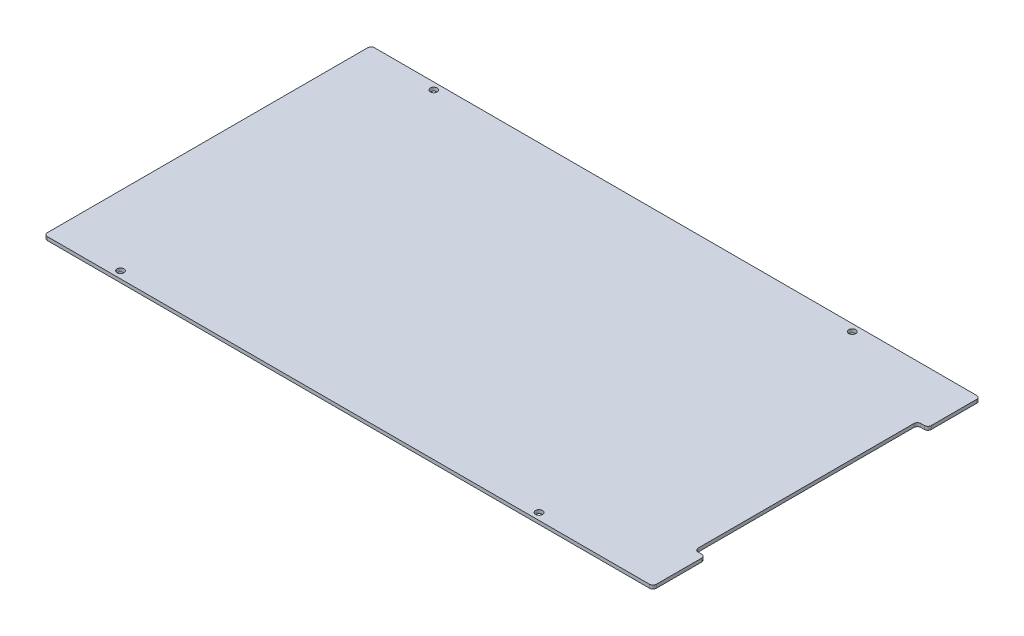
ISO-10303-21;
HEADER;
FILE_DESCRIPTION(('STEP AP214'),'2;1');
FILE_NAME('part.step','',(''),(''),'','','');
FILE_SCHEMA(('AUTOMOTIVE_DESIGN { 1 0 10303 214 1 1 1 1 }'));
ENDSEC;
DATA;
#1=APPLICATION_CONTEXT('core data for automotive mechanical design processes');
#2=APPLICATION_PROTOCOL_DEFINITION('international standard','automotive_design',2000,#1);
#3=PRODUCT_CONTEXT('',#1,'mechanical');
#4=PRODUCT('Part','Part','',(#3));
#5=PRODUCT_RELATED_PRODUCT_CATEGORY('part','',(#4));
#6=PRODUCT_DEFINITION_FORMATION('','',#4);
#7=PRODUCT_DEFINITION_CONTEXT('part definition',#1,'design');
#8=PRODUCT_DEFINITION('design','',#6,#7);
#9=PRODUCT_DEFINITION_SHAPE('','',#8);
#10=(LENGTH_UNIT() NAMED_UNIT(*) SI_UNIT(.MILLI.,.METRE.));
#11=(NAMED_UNIT(*) PLANE_ANGLE_UNIT() SI_UNIT($,.RADIAN.));
#12=(NAMED_UNIT(*) SI_UNIT($,.STERADIAN.) SOLID_ANGLE_UNIT());
#13=UNCERTAINTY_MEASURE_WITH_UNIT(LENGTH_MEASURE(1.E-05),#10,'distance_accuracy_value','');
#14=(GEOMETRIC_REPRESENTATION_CONTEXT(3) GLOBAL_UNCERTAINTY_ASSIGNED_CONTEXT((#13)) GLOBAL_UNIT_ASSIGNED_CONTEXT((#10,
#11,#12)) REPRESENTATION_CONTEXT('',''));
#15=CARTESIAN_POINT('',(0.,0.,0.));
#16=DIRECTION('',(0.,0.,1.));
#17=DIRECTION('',(1.,0.,0.));
#18=AXIS2_PLACEMENT_3D('',#15,#16,#17);
#19=CARTESIAN_POINT('',(277.8125,3.175,149.225));
#20=DIRECTION('',(-1.,0.,0.));
#21=DIRECTION('',(0.,0.,1.));
#22=AXIS2_PLACEMENT_3D('',#19,#20,#21);
#23=PLANE('',#22);
#24=DIRECTION('',(0.,0.,-1.));
#25=VECTOR('',#24,1.);
#26=CARTESIAN_POINT('',(277.8125,0.,149.225));
#27=LINE('',#26,#25);
#28=CARTESIAN_POINT('',(277.8125,0.,146.05));
#29=VERTEX_POINT('',#28);
#30=CARTESIAN_POINT('',(277.8125,0.,104.775));
#31=VERTEX_POINT('',#30);
#32=EDGE_CURVE('E201',#29,#31,#27,.T.);
#33=ORIENTED_EDGE('',*,*,#32,.T.);
#34=DIRECTION('',(0.,1.,0.));
#35=VECTOR('',#34,1.);
#36=CARTESIAN_POINT('',(277.8125,3.175,104.775));
#37=LINE('',#36,#35);
#38=CARTESIAN_POINT('',(277.8125,3.175,104.775));
#39=VERTEX_POINT('',#38);
#40=EDGE_CURVE('E254',#31,#39,#37,.T.);
#41=ORIENTED_EDGE('',*,*,#40,.T.);
#42=DIRECTION('',(0.,0.,-1.));
#43=VECTOR('',#42,1.);
#44=CARTESIAN_POINT('',(277.8125,3.175,149.225));
#45=LINE('',#44,#43);
#46=CARTESIAN_POINT('',(277.8125,3.175,146.05));
#47=VERTEX_POINT('',#46);
#48=EDGE_CURVE('E191',#47,#39,#45,.T.);
#49=ORIENTED_EDGE('',*,*,#48,.F.);
#50=DIRECTION('',(0.,-1.,0.));
#51=VECTOR('',#50,1.);
#52=CARTESIAN_POINT('',(277.8125,3.175,146.05));
#53=LINE('',#52,#51);
#54=EDGE_CURVE('E251',#47,#29,#53,.T.);
#55=ORIENTED_EDGE('',*,*,#54,.T.);
#56=EDGE_LOOP('',(#33,#41,#49,#55));
#57=FACE_BOUND('',#56,.T.);
#58=ADVANCED_FACE('F37',(#57),#23,.F.);
#59=CARTESIAN_POINT('',(277.8125,3.175,-104.775));
#60=VERTEX_POINT('',#59);
#61=CARTESIAN_POINT('',(277.8125,3.175,-146.05));
#62=VERTEX_POINT('',#61);
#63=EDGE_CURVE('E188',#60,#62,#45,.T.);
#64=ORIENTED_EDGE('',*,*,#63,.F.);
#65=DIRECTION('',(0.,1.,0.));
#66=VECTOR('',#65,1.);
#67=CARTESIAN_POINT('',(277.8125,3.175,-104.775));
#68=LINE('',#67,#66);
#69=CARTESIAN_POINT('',(277.8125,0.,-104.775));
#70=VERTEX_POINT('',#69);
#71=EDGE_CURVE('E239',#60,#70,#68,.F.);
#72=ORIENTED_EDGE('',*,*,#71,.T.);
#73=CARTESIAN_POINT('',(277.8125,0.,-146.05));
#74=VERTEX_POINT('',#73);
#75=EDGE_CURVE('E205',#70,#74,#27,.T.);
#76=ORIENTED_EDGE('',*,*,#75,.T.);
#77=DIRECTION('',(0.,-1.,0.));
#78=VECTOR('',#77,1.);
#79=CARTESIAN_POINT('',(277.8125,3.175,-146.05));
#80=LINE('',#79,#78);
#81=EDGE_CURVE('E237',#74,#62,#80,.F.);
#82=ORIENTED_EDGE('',*,*,#81,.T.);
#83=EDGE_LOOP('',(#64,#72,#76,#82));
#84=FACE_BOUND('',#83,.T.);
#85=ADVANCED_FACE('F304',(#84),#23,.F.);
#86=CARTESIAN_POINT('',(-277.8125,3.175,-149.225));
#87=DIRECTION('',(0.,0.,1.));
#88=DIRECTION('',(1.,0.,0.));
#89=AXIS2_PLACEMENT_3D('',#86,#87,#88);
#90=PLANE('',#89);
#91=DIRECTION('',(-1.,0.,0.));
#92=VECTOR('',#91,1.);
#93=CARTESIAN_POINT('',(-277.8125,3.175,-149.225));
#94=LINE('',#93,#92);
#95=CARTESIAN_POINT('',(274.6375,3.175,-149.225));
#96=VERTEX_POINT('',#95);
#97=CARTESIAN_POINT('',(-274.6375,3.175,-149.225));
#98=VERTEX_POINT('',#97);
#99=EDGE_CURVE('E193',#96,#98,#94,.T.);
#100=ORIENTED_EDGE('',*,*,#99,.F.);
#101=DIRECTION('',(0.,-1.,0.));
#102=VECTOR('',#101,1.);
#103=CARTESIAN_POINT('',(274.6375,3.175,-149.225));
#104=LINE('',#103,#102);
#105=CARTESIAN_POINT('',(274.6375,0.,-149.225));
#106=VERTEX_POINT('',#105);
#107=EDGE_CURVE('E261',#96,#106,#104,.T.);
#108=ORIENTED_EDGE('',*,*,#107,.T.);
#109=DIRECTION('',(-1.,0.,0.));
#110=VECTOR('',#109,1.);
#111=CARTESIAN_POINT('',(-277.8125,0.,-149.225));
#112=LINE('',#111,#110);
#113=CARTESIAN_POINT('',(-274.6375,0.,-149.225));
#114=VERTEX_POINT('',#113);
#115=EDGE_CURVE('E204',#106,#114,#112,.T.);
#116=ORIENTED_EDGE('',*,*,#115,.T.);
#117=DIRECTION('',(0.,-1.,0.));
#118=VECTOR('',#117,1.);
#119=CARTESIAN_POINT('',(-274.6375,3.175,-149.225));
#120=LINE('',#119,#118);
#121=EDGE_CURVE('E259',#114,#98,#120,.F.);
#122=ORIENTED_EDGE('',*,*,#121,.T.);
#123=EDGE_LOOP('',(#100,#108,#116,#122));
#124=FACE_BOUND('',#123,.T.);
#125=ADVANCED_FACE('F297',(#124),#90,.F.);
#126=CARTESIAN_POINT('',(-277.8125,3.175,149.225));
#127=DIRECTION('',(1.,0.,0.));
#128=DIRECTION('',(0.,0.,-1.));
#129=AXIS2_PLACEMENT_3D('',#126,#127,#128);
#130=PLANE('',#129);
#131=DIRECTION('',(0.,0.,1.));
#132=VECTOR('',#131,1.);
#133=CARTESIAN_POINT('',(-277.8125,3.175,149.225));
#134=LINE('',#133,#132);
#135=CARTESIAN_POINT('',(-277.8125,3.175,-146.05));
#136=VERTEX_POINT('',#135);
#137=CARTESIAN_POINT('',(-277.8125,3.175,146.05));
#138=VERTEX_POINT('',#137);
#139=EDGE_CURVE('E196',#136,#138,#134,.T.);
#140=ORIENTED_EDGE('',*,*,#139,.F.);
#141=DIRECTION('',(0.,-1.,0.));
#142=VECTOR('',#141,1.);
#143=CARTESIAN_POINT('',(-277.8125,3.175,-146.05));
#144=LINE('',#143,#142);
#145=CARTESIAN_POINT('',(-277.8125,0.,-146.05));
#146=VERTEX_POINT('',#145);
#147=EDGE_CURVE('E265',#136,#146,#144,.T.);
#148=ORIENTED_EDGE('',*,*,#147,.T.);
#149=DIRECTION('',(0.,0.,1.));
#150=VECTOR('',#149,1.);
#151=CARTESIAN_POINT('',(-277.8125,0.,149.225));
#152=LINE('',#151,#150);
#153=CARTESIAN_POINT('',(-277.8125,0.,146.05));
#154=VERTEX_POINT('',#153);
#155=EDGE_CURVE('E207',#146,#154,#152,.T.);
#156=ORIENTED_EDGE('',*,*,#155,.T.);
#157=DIRECTION('',(0.,-1.,0.));
#158=VECTOR('',#157,1.);
#159=CARTESIAN_POINT('',(-277.8125,3.175,146.05));
#160=LINE('',#159,#158);
#161=EDGE_CURVE('E263',#154,#138,#160,.F.);
#162=ORIENTED_EDGE('',*,*,#161,.T.);
#163=EDGE_LOOP('',(#140,#148,#156,#162));
#164=FACE_BOUND('',#163,.T.);
#165=ADVANCED_FACE('F289',(#164),#130,.F.);
#166=CARTESIAN_POINT('',(-277.8125,3.175,149.225));
#167=DIRECTION('',(0.,0.,-1.));
#168=DIRECTION('',(-1.,0.,0.));
#169=AXIS2_PLACEMENT_3D('',#166,#167,#168);
#170=PLANE('',#169);
#171=DIRECTION('',(1.,0.,0.));
#172=VECTOR('',#171,1.);
#173=CARTESIAN_POINT('',(-277.8125,0.,149.225));
#174=LINE('',#173,#172);
#175=CARTESIAN_POINT('',(-274.6375,0.,149.225));
#176=VERTEX_POINT('',#175);
#177=CARTESIAN_POINT('',(274.6375,0.,149.225));
#178=VERTEX_POINT('',#177);
#179=EDGE_CURVE('E192',#176,#178,#174,.T.);
#180=ORIENTED_EDGE('',*,*,#179,.T.);
#181=DIRECTION('',(0.,-1.,0.));
#182=VECTOR('',#181,1.);
#183=CARTESIAN_POINT('',(274.6375,3.175,149.225));
#184=LINE('',#183,#182);
#185=CARTESIAN_POINT('',(274.6375,3.175,149.225));
#186=VERTEX_POINT('',#185);
#187=EDGE_CURVE('E11',#178,#186,#184,.F.);
#188=ORIENTED_EDGE('',*,*,#187,.T.);
#189=DIRECTION('',(1.,0.,0.));
#190=VECTOR('',#189,1.);
#191=CARTESIAN_POINT('',(-277.8125,3.175,149.225));
#192=LINE('',#191,#190);
#193=CARTESIAN_POINT('',(-274.6375,3.175,149.225));
#194=VERTEX_POINT('',#193);
#195=EDGE_CURVE('E173',#194,#186,#192,.T.);
#196=ORIENTED_EDGE('',*,*,#195,.F.);
#197=DIRECTION('',(0.,-1.,0.));
#198=VECTOR('',#197,1.);
#199=CARTESIAN_POINT('',(-274.6375,3.175,149.225));
#200=LINE('',#199,#198);
#201=EDGE_CURVE('E45',#194,#176,#200,.T.);
#202=ORIENTED_EDGE('',*,*,#201,.T.);
#203=EDGE_LOOP('',(#180,#188,#196,#202));
#204=FACE_BOUND('',#203,.T.);
#205=ADVANCED_FACE('F272',(#204),#170,.F.);
#206=CARTESIAN_POINT('',(0.,3.175,0.));
#207=DIRECTION('',(0.,-1.,0.));
#208=DIRECTION('',(0.,0.,-1.));
#209=AXIS2_PLACEMENT_3D('',#206,#207,#208);
#210=PLANE('',#209);
#211=CARTESIAN_POINT('',(167.5765,3.175,-142.875));
#212=DIRECTION('',(0.,-1.,0.));
#213=DIRECTION('',(0.,0.,-1.));
#214=AXIS2_PLACEMENT_3D('',#211,#212,#213);
#215=CIRCLE('',#214,3.17500000000001);
#216=CARTESIAN_POINT('',(167.5765,3.175,-146.05));
#217=VERTEX_POINT('',#216);
#218=EDGE_CURVE('E332',#217,#217,#215,.T.);
#219=ORIENTED_EDGE('',*,*,#218,.T.);
#220=EDGE_LOOP('',(#219));
#221=FACE_BOUND('',#220,.T.);
#222=CARTESIAN_POINT('',(-214.3125,3.175,-142.875));
#223=DIRECTION('',(0.,-1.,0.));
#224=DIRECTION('',(0.,0.,-1.));
#225=AXIS2_PLACEMENT_3D('',#222,#223,#224);
#226=CIRCLE('',#225,3.17500000000001);
#227=CARTESIAN_POINT('',(-214.3125,3.175,-146.05));
#228=VERTEX_POINT('',#227);
#229=EDGE_CURVE('E326',#228,#228,#226,.T.);
#230=ORIENTED_EDGE('',*,*,#229,.T.);
#231=EDGE_LOOP('',(#230));
#232=FACE_BOUND('',#231,.T.);
#233=CARTESIAN_POINT('',(167.5765,3.175,142.875));
#234=DIRECTION('',(0.,-1.,0.));
#235=DIRECTION('',(0.,0.,-1.));
#236=AXIS2_PLACEMENT_3D('',#233,#234,#235);
#237=CIRCLE('',#236,3.17500000000001);
#238=CARTESIAN_POINT('',(167.5765,3.175,139.7));
#239=VERTEX_POINT('',#238);
#240=EDGE_CURVE('E318',#239,#239,#237,.T.);
#241=ORIENTED_EDGE('',*,*,#240,.T.);
#242=EDGE_LOOP('',(#241));
#243=FACE_BOUND('',#242,.T.);
#244=CARTESIAN_POINT('',(-214.3125,3.175,142.875));
#245=DIRECTION('',(0.,-1.,0.));
#246=DIRECTION('',(0.,0.,-1.));
#247=AXIS2_PLACEMENT_3D('',#244,#245,#246);
#248=CIRCLE('',#247,3.17500000000001);
#249=CARTESIAN_POINT('',(-214.3125,3.175,139.7));
#250=VERTEX_POINT('',#249);
#251=EDGE_CURVE('E310',#250,#250,#248,.T.);
#252=ORIENTED_EDGE('',*,*,#251,.T.);
#253=EDGE_LOOP('',(#252));
#254=FACE_BOUND('',#253,.T.);
#255=DIRECTION('',(-1.,0.,0.));
#256=VECTOR('',#255,1.);
#257=CARTESIAN_POINT('',(277.8125,3.175,-101.6));
#258=LINE('',#257,#256);
#259=CARTESIAN_POINT('',(274.6375,3.175,-101.6));
#260=VERTEX_POINT('',#259);
#261=CARTESIAN_POINT('',(271.4625,3.175,-101.6));
#262=VERTEX_POINT('',#261);
#263=EDGE_CURVE('E184',#260,#262,#258,.T.);
#264=ORIENTED_EDGE('',*,*,#263,.F.);
#265=CARTESIAN_POINT('',(274.6375,3.175,-104.775));
#266=DIRECTION('',(0.,-1.,0.));
#267=DIRECTION('',(0.,0.,-1.));
#268=AXIS2_PLACEMENT_3D('',#265,#266,#267);
#269=CIRCLE('',#268,3.175);
#270=EDGE_CURVE('E235',#260,#60,#269,.F.);
#271=ORIENTED_EDGE('',*,*,#270,.T.);
#272=ORIENTED_EDGE('',*,*,#63,.T.);
#273=CARTESIAN_POINT('',(274.6375,3.175,-146.05));
#274=DIRECTION('',(0.,-1.,0.));
#275=DIRECTION('',(0.,0.,-1.));
#276=AXIS2_PLACEMENT_3D('',#273,#274,#275);
#277=CIRCLE('',#276,3.175);
#278=EDGE_CURVE('E232',#62,#96,#277,.F.);
#279=ORIENTED_EDGE('',*,*,#278,.T.);
#280=ORIENTED_EDGE('',*,*,#99,.T.);
#281=CARTESIAN_POINT('',(-274.6375,3.175,-146.05));
#282=DIRECTION('',(0.,-1.,0.));
#283=DIRECTION('',(0.,0.,-1.));
#284=AXIS2_PLACEMENT_3D('',#281,#282,#283);
#285=CIRCLE('',#284,3.175);
#286=EDGE_CURVE('E230',#98,#136,#285,.F.);
#287=ORIENTED_EDGE('',*,*,#286,.T.);
#288=ORIENTED_EDGE('',*,*,#139,.T.);
#289=CARTESIAN_POINT('',(-274.6375,3.175,146.05));
#290=DIRECTION('',(0.,-1.,0.));
#291=DIRECTION('',(0.,0.,-1.));
#292=AXIS2_PLACEMENT_3D('',#289,#290,#291);
#293=CIRCLE('',#292,3.175);
#294=EDGE_CURVE('E226',#138,#194,#293,.F.);
#295=ORIENTED_EDGE('',*,*,#294,.T.);
#296=ORIENTED_EDGE('',*,*,#195,.T.);
#297=CARTESIAN_POINT('',(274.6375,3.175,146.05));
#298=DIRECTION('',(0.,-1.,0.));
#299=DIRECTION('',(0.,0.,-1.));
#300=AXIS2_PLACEMENT_3D('',#297,#298,#299);
#301=CIRCLE('',#300,3.175);
#302=EDGE_CURVE('E228',#186,#47,#301,.F.);
#303=ORIENTED_EDGE('',*,*,#302,.T.);
#304=ORIENTED_EDGE('',*,*,#48,.T.);
#305=CARTESIAN_POINT('',(274.6375,3.175,104.775));
#306=DIRECTION('',(0.,-1.,0.));
#307=DIRECTION('',(0.,0.,-1.));
#308=AXIS2_PLACEMENT_3D('',#305,#306,#307);
#309=CIRCLE('',#308,3.175);
#310=CARTESIAN_POINT('',(274.6375,3.175,101.6));
#311=VERTEX_POINT('',#310);
#312=EDGE_CURVE('E178',#39,#311,#309,.F.);
#313=ORIENTED_EDGE('',*,*,#312,.T.);
#314=DIRECTION('',(1.,0.,0.));
#315=VECTOR('',#314,1.);
#316=CARTESIAN_POINT('',(277.8125,3.175,101.6));
#317=LINE('',#316,#315);
#318=CARTESIAN_POINT('',(271.4625,3.175,101.6));
#319=VERTEX_POINT('',#318);
#320=EDGE_CURVE('E168',#319,#311,#317,.T.);
#321=ORIENTED_EDGE('',*,*,#320,.F.);
#322=CARTESIAN_POINT('',(271.4625,3.175,98.425));
#323=DIRECTION('',(0.,-1.,0.));
#324=DIRECTION('',(0.,0.,-1.));
#325=AXIS2_PLACEMENT_3D('',#322,#323,#324);
#326=CIRCLE('',#325,3.175);
#327=CARTESIAN_POINT('',(268.2875,3.175,98.425));
#328=VERTEX_POINT('',#327);
#329=EDGE_CURVE('E151',#319,#328,#326,.T.);
#330=ORIENTED_EDGE('',*,*,#329,.T.);
#331=DIRECTION('',(0.,0.,1.));
#332=VECTOR('',#331,1.);
#333=CARTESIAN_POINT('',(268.2875,3.175,-101.6));
#334=LINE('',#333,#332);
#335=CARTESIAN_POINT('',(268.2875,3.175,-98.425));
#336=VERTEX_POINT('',#335);
#337=EDGE_CURVE('E180',#336,#328,#334,.T.);
#338=ORIENTED_EDGE('',*,*,#337,.F.);
#339=CARTESIAN_POINT('',(271.4625,3.175,-98.425));
#340=DIRECTION('',(0.,-1.,0.));
#341=DIRECTION('',(0.,0.,-1.));
#342=AXIS2_PLACEMENT_3D('',#339,#340,#341);
#343=CIRCLE('',#342,3.175);
#344=EDGE_CURVE('E218',#336,#262,#343,.T.);
#345=ORIENTED_EDGE('',*,*,#344,.T.);
#346=EDGE_LOOP('',(#264,#271,#272,#279,#280,#287,#288,#295,#296,#303,#304,#313,#321,#330,#338,#345));
#347=FACE_BOUND('',#346,.T.);
#348=ADVANCED_FACE('F176',(#221,#232,#243,#254,#347),#210,.F.);
#349=CARTESIAN_POINT('',(0.,0.,0.));
#350=DIRECTION('',(0.,-1.,0.));
#351=DIRECTION('',(0.,0.,-1.));
#352=AXIS2_PLACEMENT_3D('',#349,#350,#351);
#353=PLANE('',#352);
#354=CARTESIAN_POINT('',(167.5765,0.,-142.875));
#355=DIRECTION('',(0.,-1.,0.));
#356=DIRECTION('',(0.,0.,-1.));
#357=AXIS2_PLACEMENT_3D('',#354,#355,#356);
#358=CIRCLE('',#357,3.17499999999998);
#359=CARTESIAN_POINT('',(167.5765,0.,-146.05));
#360=VERTEX_POINT('',#359);
#361=EDGE_CURVE('E335',#360,#360,#358,.T.);
#362=ORIENTED_EDGE('',*,*,#361,.F.);
#363=EDGE_LOOP('',(#362));
#364=FACE_BOUND('',#363,.T.);
#365=CARTESIAN_POINT('',(-214.3125,0.,-142.875));
#366=DIRECTION('',(0.,-1.,0.));
#367=DIRECTION('',(0.,0.,-1.));
#368=AXIS2_PLACEMENT_3D('',#365,#366,#367);
#369=CIRCLE('',#368,3.17499999999998);
#370=CARTESIAN_POINT('',(-214.3125,0.,-146.05));
#371=VERTEX_POINT('',#370);
#372=EDGE_CURVE('E329',#371,#371,#369,.T.);
#373=ORIENTED_EDGE('',*,*,#372,.F.);
#374=EDGE_LOOP('',(#373));
#375=FACE_BOUND('',#374,.T.);
#376=CARTESIAN_POINT('',(167.5765,0.,142.875));
#377=DIRECTION('',(0.,-1.,0.));
#378=DIRECTION('',(0.,0.,-1.));
#379=AXIS2_PLACEMENT_3D('',#376,#377,#378);
#380=CIRCLE('',#379,3.17499999999998);
#381=CARTESIAN_POINT('',(167.5765,0.,139.7));
#382=VERTEX_POINT('',#381);
#383=EDGE_CURVE('E323',#382,#382,#380,.T.);
#384=ORIENTED_EDGE('',*,*,#383,.F.);
#385=EDGE_LOOP('',(#384));
#386=FACE_BOUND('',#385,.T.);
#387=CARTESIAN_POINT('',(-214.3125,0.,142.875));
#388=DIRECTION('',(0.,-1.,0.));
#389=DIRECTION('',(0.,0.,-1.));
#390=AXIS2_PLACEMENT_3D('',#387,#388,#389);
#391=CIRCLE('',#390,3.17499999999998);
#392=CARTESIAN_POINT('',(-214.3125,0.,139.7));
#393=VERTEX_POINT('',#392);
#394=EDGE_CURVE('E313',#393,#393,#391,.T.);
#395=ORIENTED_EDGE('',*,*,#394,.F.);
#396=EDGE_LOOP('',(#395));
#397=FACE_BOUND('',#396,.T.);
#398=ORIENTED_EDGE('',*,*,#75,.F.);
#399=CARTESIAN_POINT('',(274.6375,0.,-104.775));
#400=DIRECTION('',(0.,-1.,0.));
#401=DIRECTION('',(0.,0.,-1.));
#402=AXIS2_PLACEMENT_3D('',#399,#400,#401);
#403=CIRCLE('',#402,3.175);
#404=CARTESIAN_POINT('',(274.6375,0.,-101.6));
#405=VERTEX_POINT('',#404);
#406=EDGE_CURVE('E249',#70,#405,#403,.T.);
#407=ORIENTED_EDGE('',*,*,#406,.T.);
#408=DIRECTION('',(-1.,0.,0.));
#409=VECTOR('',#408,1.);
#410=CARTESIAN_POINT('',(277.8125,0.,-101.6));
#411=LINE('',#410,#409);
#412=CARTESIAN_POINT('',(271.4625,0.,-101.6));
#413=VERTEX_POINT('',#412);
#414=EDGE_CURVE('E179',#405,#413,#411,.T.);
#415=ORIENTED_EDGE('',*,*,#414,.T.);
#416=CARTESIAN_POINT('',(271.4625,0.,-98.425));
#417=DIRECTION('',(0.,-1.,0.));
#418=DIRECTION('',(0.,0.,-1.));
#419=AXIS2_PLACEMENT_3D('',#416,#417,#418);
#420=CIRCLE('',#419,3.175);
#421=CARTESIAN_POINT('',(268.2875,0.,-98.425));
#422=VERTEX_POINT('',#421);
#423=EDGE_CURVE('E221',#413,#422,#420,.F.);
#424=ORIENTED_EDGE('',*,*,#423,.T.);
#425=DIRECTION('',(0.,0.,1.));
#426=VECTOR('',#425,1.);
#427=CARTESIAN_POINT('',(268.2875,0.,-101.6));
#428=LINE('',#427,#426);
#429=CARTESIAN_POINT('',(268.2875,0.,98.425));
#430=VERTEX_POINT('',#429);
#431=EDGE_CURVE('E182',#422,#430,#428,.T.);
#432=ORIENTED_EDGE('',*,*,#431,.T.);
#433=CARTESIAN_POINT('',(271.4625,0.,98.425));
#434=DIRECTION('',(0.,-1.,0.));
#435=DIRECTION('',(0.,0.,-1.));
#436=AXIS2_PLACEMENT_3D('',#433,#434,#435);
#437=CIRCLE('',#436,3.175);
#438=CARTESIAN_POINT('',(271.4625,0.,101.6));
#439=VERTEX_POINT('',#438);
#440=EDGE_CURVE('E161',#430,#439,#437,.F.);
#441=ORIENTED_EDGE('',*,*,#440,.T.);
#442=DIRECTION('',(1.,0.,0.));
#443=VECTOR('',#442,1.);
#444=CARTESIAN_POINT('',(277.8125,0.,101.6));
#445=LINE('',#444,#443);
#446=CARTESIAN_POINT('',(274.6375,0.,101.6));
#447=VERTEX_POINT('',#446);
#448=EDGE_CURVE('E171',#439,#447,#445,.T.);
#449=ORIENTED_EDGE('',*,*,#448,.T.);
#450=CARTESIAN_POINT('',(274.6375,0.,104.775));
#451=DIRECTION('',(0.,-1.,0.));
#452=DIRECTION('',(0.,0.,-1.));
#453=AXIS2_PLACEMENT_3D('',#450,#451,#452);
#454=CIRCLE('',#453,3.175);
#455=EDGE_CURVE('E247',#447,#31,#454,.T.);
#456=ORIENTED_EDGE('',*,*,#455,.T.);
#457=ORIENTED_EDGE('',*,*,#32,.F.);
#458=CARTESIAN_POINT('',(274.6375,0.,146.05));
#459=DIRECTION('',(0.,-1.,0.));
#460=DIRECTION('',(0.,0.,-1.));
#461=AXIS2_PLACEMENT_3D('',#458,#459,#460);
#462=CIRCLE('',#461,3.175);
#463=EDGE_CURVE('E243',#29,#178,#462,.T.);
#464=ORIENTED_EDGE('',*,*,#463,.T.);
#465=ORIENTED_EDGE('',*,*,#179,.F.);
#466=CARTESIAN_POINT('',(-274.6375,0.,146.05));
#467=DIRECTION('',(0.,-1.,0.));
#468=DIRECTION('',(0.,0.,-1.));
#469=AXIS2_PLACEMENT_3D('',#466,#467,#468);
#470=CIRCLE('',#469,3.175);
#471=EDGE_CURVE('E241',#176,#154,#470,.T.);
#472=ORIENTED_EDGE('',*,*,#471,.T.);
#473=ORIENTED_EDGE('',*,*,#155,.F.);
#474=CARTESIAN_POINT('',(-274.6375,0.,-146.05));
#475=DIRECTION('',(0.,-1.,0.));
#476=DIRECTION('',(0.,0.,-1.));
#477=AXIS2_PLACEMENT_3D('',#474,#475,#476);
#478=CIRCLE('',#477,3.175);
#479=EDGE_CURVE('E52',#146,#114,#478,.T.);
#480=ORIENTED_EDGE('',*,*,#479,.T.);
#481=ORIENTED_EDGE('',*,*,#115,.F.);
#482=CARTESIAN_POINT('',(274.6375,0.,-146.05));
#483=DIRECTION('',(0.,-1.,0.));
#484=DIRECTION('',(0.,0.,-1.));
#485=AXIS2_PLACEMENT_3D('',#482,#483,#484);
#486=CIRCLE('',#485,3.175);
#487=EDGE_CURVE('E60',#106,#74,#486,.T.);
#488=ORIENTED_EDGE('',*,*,#487,.T.);
#489=EDGE_LOOP('',(#398,#407,#415,#424,#432,#441,#449,#456,#457,#464,#465,#472,#473,#480,#481,#488));
#490=FACE_BOUND('',#489,.T.);
#491=ADVANCED_FACE('F277',(#364,#375,#386,#397,#490),#353,.T.);
#492=CARTESIAN_POINT('',(277.8125,0.,101.6));
#493=DIRECTION('',(0.,0.,1.));
#494=DIRECTION('',(1.,0.,0.));
#495=AXIS2_PLACEMENT_3D('',#492,#493,#494);
#496=PLANE('',#495);
#497=ORIENTED_EDGE('',*,*,#320,.T.);
#498=DIRECTION('',(0.,1.,0.));
#499=VECTOR('',#498,1.);
#500=CARTESIAN_POINT('',(274.6375,0.,101.6));
#501=LINE('',#500,#499);
#502=EDGE_CURVE('E257',#311,#447,#501,.F.);
#503=ORIENTED_EDGE('',*,*,#502,.T.);
#504=ORIENTED_EDGE('',*,*,#448,.F.);
#505=DIRECTION('',(0.,1.,0.));
#506=VECTOR('',#505,1.);
#507=CARTESIAN_POINT('',(271.4625,3.175,101.6));
#508=LINE('',#507,#506);
#509=EDGE_CURVE('E155',#439,#319,#508,.T.);
#510=ORIENTED_EDGE('',*,*,#509,.T.);
#511=EDGE_LOOP('',(#497,#503,#504,#510));
#512=FACE_BOUND('',#511,.T.);
#513=ADVANCED_FACE('F167',(#512),#496,.F.);
#514=CARTESIAN_POINT('',(268.2875,0.,-101.6));
#515=DIRECTION('',(-1.,0.,0.));
#516=DIRECTION('',(0.,0.,1.));
#517=AXIS2_PLACEMENT_3D('',#514,#515,#516);
#518=PLANE('',#517);
#519=ORIENTED_EDGE('',*,*,#337,.T.);
#520=DIRECTION('',(0.,1.,0.));
#521=VECTOR('',#520,1.);
#522=CARTESIAN_POINT('',(268.2875,0.,98.425));
#523=LINE('',#522,#521);
#524=EDGE_CURVE('E156',#328,#430,#523,.F.);
#525=ORIENTED_EDGE('',*,*,#524,.T.);
#526=ORIENTED_EDGE('',*,*,#431,.F.);
#527=DIRECTION('',(0.,1.,0.));
#528=VECTOR('',#527,1.);
#529=CARTESIAN_POINT('',(268.2875,3.175,-98.425));
#530=LINE('',#529,#528);
#531=EDGE_CURVE('E172',#422,#336,#530,.T.);
#532=ORIENTED_EDGE('',*,*,#531,.T.);
#533=EDGE_LOOP('',(#519,#525,#526,#532));
#534=FACE_BOUND('',#533,.T.);
#535=ADVANCED_FACE('F448',(#534),#518,.F.);
#536=CARTESIAN_POINT('',(277.8125,0.,-101.6));
#537=DIRECTION('',(0.,0.,-1.));
#538=DIRECTION('',(-1.,0.,0.));
#539=AXIS2_PLACEMENT_3D('',#536,#537,#538);
#540=PLANE('',#539);
#541=ORIENTED_EDGE('',*,*,#414,.F.);
#542=DIRECTION('',(0.,1.,0.));
#543=VECTOR('',#542,1.);
#544=CARTESIAN_POINT('',(274.6375,0.,-101.6));
#545=LINE('',#544,#543);
#546=EDGE_CURVE('E223',#405,#260,#545,.T.);
#547=ORIENTED_EDGE('',*,*,#546,.T.);
#548=ORIENTED_EDGE('',*,*,#263,.T.);
#549=DIRECTION('',(0.,1.,0.));
#550=VECTOR('',#549,1.);
#551=CARTESIAN_POINT('',(271.4625,0.,-101.6));
#552=LINE('',#551,#550);
#553=EDGE_CURVE('E162',#262,#413,#552,.F.);
#554=ORIENTED_EDGE('',*,*,#553,.T.);
#555=EDGE_LOOP('',(#541,#547,#548,#554));
#556=FACE_BOUND('',#555,.T.);
#557=ADVANCED_FACE('F376',(#556),#540,.F.);
#558=CARTESIAN_POINT('',(271.4625,0.,98.425));
#559=DIRECTION('',(0.,-1.,0.));
#560=DIRECTION('',(0.,0.,-1.));
#561=AXIS2_PLACEMENT_3D('',#558,#559,#560);
#562=CYLINDRICAL_SURFACE('',#561,3.175);
#563=ORIENTED_EDGE('',*,*,#440,.F.);
#564=ORIENTED_EDGE('',*,*,#524,.F.);
#565=ORIENTED_EDGE('',*,*,#329,.F.);
#566=ORIENTED_EDGE('',*,*,#509,.F.);
#567=EDGE_LOOP('',(#563,#564,#565,#566));
#568=FACE_BOUND('',#567,.T.);
#569=ADVANCED_FACE('F154',(#568),#562,.F.);
#570=CARTESIAN_POINT('',(271.4625,0.,-98.425));
#571=DIRECTION('',(0.,-1.,0.));
#572=DIRECTION('',(0.,0.,-1.));
#573=AXIS2_PLACEMENT_3D('',#570,#571,#572);
#574=CYLINDRICAL_SURFACE('',#573,3.175);
#575=ORIENTED_EDGE('',*,*,#423,.F.);
#576=ORIENTED_EDGE('',*,*,#553,.F.);
#577=ORIENTED_EDGE('',*,*,#344,.F.);
#578=ORIENTED_EDGE('',*,*,#531,.F.);
#579=EDGE_LOOP('',(#575,#576,#577,#578));
#580=FACE_BOUND('',#579,.T.);
#581=ADVANCED_FACE('F353',(#580),#574,.F.);
#582=CARTESIAN_POINT('',(-214.3125,0.,142.875));
#583=DIRECTION('',(0.,-1.,0.));
#584=DIRECTION('',(0.,0.,-1.));
#585=AXIS2_PLACEMENT_3D('',#582,#583,#584);
#586=CYLINDRICAL_SURFACE('',#585,3.175);
#587=ORIENTED_EDGE('',*,*,#251,.F.);
#588=EDGE_LOOP('',(#587));
#589=FACE_BOUND('',#588,.T.);
#590=ORIENTED_EDGE('',*,*,#394,.T.);
#591=EDGE_LOOP('',(#590));
#592=FACE_BOUND('',#591,.T.);
#593=ADVANCED_FACE('F350',(#589,#592),#586,.F.);
#594=CARTESIAN_POINT('',(167.5765,0.,142.875));
#595=DIRECTION('',(0.,-1.,0.));
#596=DIRECTION('',(0.,0.,-1.));
#597=AXIS2_PLACEMENT_3D('',#594,#595,#596);
#598=CYLINDRICAL_SURFACE('',#597,3.175);
#599=ORIENTED_EDGE('',*,*,#240,.F.);
#600=EDGE_LOOP('',(#599));
#601=FACE_BOUND('',#600,.T.);
#602=ORIENTED_EDGE('',*,*,#383,.T.);
#603=EDGE_LOOP('',(#602));
#604=FACE_BOUND('',#603,.T.);
#605=ADVANCED_FACE('F352',(#601,#604),#598,.F.);
#606=CARTESIAN_POINT('',(-214.3125,0.,-142.875));
#607=DIRECTION('',(0.,-1.,0.));
#608=DIRECTION('',(0.,0.,-1.));
#609=AXIS2_PLACEMENT_3D('',#606,#607,#608);
#610=CYLINDRICAL_SURFACE('',#609,3.175);
#611=ORIENTED_EDGE('',*,*,#229,.F.);
#612=EDGE_LOOP('',(#611));
#613=FACE_BOUND('',#612,.T.);
#614=ORIENTED_EDGE('',*,*,#372,.T.);
#615=EDGE_LOOP('',(#614));
#616=FACE_BOUND('',#615,.T.);
#617=ADVANCED_FACE('F360',(#613,#616),#610,.F.);
#618=CARTESIAN_POINT('',(167.5765,0.,-142.875));
#619=DIRECTION('',(0.,-1.,0.));
#620=DIRECTION('',(0.,0.,-1.));
#621=AXIS2_PLACEMENT_3D('',#618,#619,#620);
#622=CYLINDRICAL_SURFACE('',#621,3.175);
#623=ORIENTED_EDGE('',*,*,#218,.F.);
#624=EDGE_LOOP('',(#623));
#625=FACE_BOUND('',#624,.T.);
#626=ORIENTED_EDGE('',*,*,#361,.T.);
#627=EDGE_LOOP('',(#626));
#628=FACE_BOUND('',#627,.T.);
#629=ADVANCED_FACE('F339',(#625,#628),#622,.F.);
#630=CARTESIAN_POINT('',(274.6375,0.,-104.775));
#631=DIRECTION('',(0.,1.,0.));
#632=DIRECTION('',(0.,0.,1.));
#633=AXIS2_PLACEMENT_3D('',#630,#631,#632);
#634=CYLINDRICAL_SURFACE('',#633,3.175);
#635=ORIENTED_EDGE('',*,*,#406,.F.);
#636=ORIENTED_EDGE('',*,*,#71,.F.);
#637=ORIENTED_EDGE('',*,*,#270,.F.);
#638=ORIENTED_EDGE('',*,*,#546,.F.);
#639=EDGE_LOOP('',(#635,#636,#637,#638));
#640=FACE_BOUND('',#639,.T.);
#641=ADVANCED_FACE('F378',(#640),#634,.T.);
#642=CARTESIAN_POINT('',(274.6375,3.175,104.775));
#643=DIRECTION('',(0.,1.,0.));
#644=DIRECTION('',(0.,0.,1.));
#645=AXIS2_PLACEMENT_3D('',#642,#643,#644);
#646=CYLINDRICAL_SURFACE('',#645,3.175);
#647=ORIENTED_EDGE('',*,*,#455,.F.);
#648=ORIENTED_EDGE('',*,*,#502,.F.);
#649=ORIENTED_EDGE('',*,*,#312,.F.);
#650=ORIENTED_EDGE('',*,*,#40,.F.);
#651=EDGE_LOOP('',(#647,#648,#649,#650));
#652=FACE_BOUND('',#651,.T.);
#653=ADVANCED_FACE('F381',(#652),#646,.T.);
#654=CARTESIAN_POINT('',(274.6375,3.175,-146.05));
#655=DIRECTION('',(0.,-1.,0.));
#656=DIRECTION('',(0.,0.,-1.));
#657=AXIS2_PLACEMENT_3D('',#654,#655,#656);
#658=CYLINDRICAL_SURFACE('',#657,3.175);
#659=ORIENTED_EDGE('',*,*,#278,.F.);
#660=ORIENTED_EDGE('',*,*,#81,.F.);
#661=ORIENTED_EDGE('',*,*,#487,.F.);
#662=ORIENTED_EDGE('',*,*,#107,.F.);
#663=EDGE_LOOP('',(#659,#660,#661,#662));
#664=FACE_BOUND('',#663,.T.);
#665=ADVANCED_FACE('F300',(#664),#658,.T.);
#666=CARTESIAN_POINT('',(-274.6375,3.175,-146.05));
#667=DIRECTION('',(0.,-1.,0.));
#668=DIRECTION('',(0.,0.,-1.));
#669=AXIS2_PLACEMENT_3D('',#666,#667,#668);
#670=CYLINDRICAL_SURFACE('',#669,3.175);
#671=ORIENTED_EDGE('',*,*,#286,.F.);
#672=ORIENTED_EDGE('',*,*,#121,.F.);
#673=ORIENTED_EDGE('',*,*,#479,.F.);
#674=ORIENTED_EDGE('',*,*,#147,.F.);
#675=EDGE_LOOP('',(#671,#672,#673,#674));
#676=FACE_BOUND('',#675,.T.);
#677=ADVANCED_FACE('F293',(#676),#670,.T.);
#678=CARTESIAN_POINT('',(274.6375,3.175,146.05));
#679=DIRECTION('',(0.,-1.,0.));
#680=DIRECTION('',(0.,0.,-1.));
#681=AXIS2_PLACEMENT_3D('',#678,#679,#680);
#682=CYLINDRICAL_SURFACE('',#681,3.175);
#683=ORIENTED_EDGE('',*,*,#302,.F.);
#684=ORIENTED_EDGE('',*,*,#187,.F.);
#685=ORIENTED_EDGE('',*,*,#463,.F.);
#686=ORIENTED_EDGE('',*,*,#54,.F.);
#687=EDGE_LOOP('',(#683,#684,#685,#686));
#688=FACE_BOUND('',#687,.T.);
#689=ADVANCED_FACE('F282',(#688),#682,.T.);
#690=CARTESIAN_POINT('',(-274.6375,3.175,146.05));
#691=DIRECTION('',(0.,-1.,0.));
#692=DIRECTION('',(0.,0.,-1.));
#693=AXIS2_PLACEMENT_3D('',#690,#691,#692);
#694=CYLINDRICAL_SURFACE('',#693,3.175);
#695=ORIENTED_EDGE('',*,*,#294,.F.);
#696=ORIENTED_EDGE('',*,*,#161,.F.);
#697=ORIENTED_EDGE('',*,*,#471,.F.);
#698=ORIENTED_EDGE('',*,*,#201,.F.);
#699=EDGE_LOOP('',(#695,#696,#697,#698));
#700=FACE_BOUND('',#699,.T.);
#701=ADVANCED_FACE('F39',(#700),#694,.T.);
#702=CLOSED_SHELL('',(#58,#85,#125,#165,#205,#348,#491,#513,#535,#557,#569,#581,#593,#605,#617,
#629,#641,#653,#665,#677,#689,#701));
#703=MANIFOLD_SOLID_BREP('B2',#702);
#704=ADVANCED_BREP_SHAPE_REPRESENTATION('',(#18,#703),#14);
#705=SHAPE_DEFINITION_REPRESENTATION(#9,#704);
ENDSEC;
END-ISO-10303-21;
